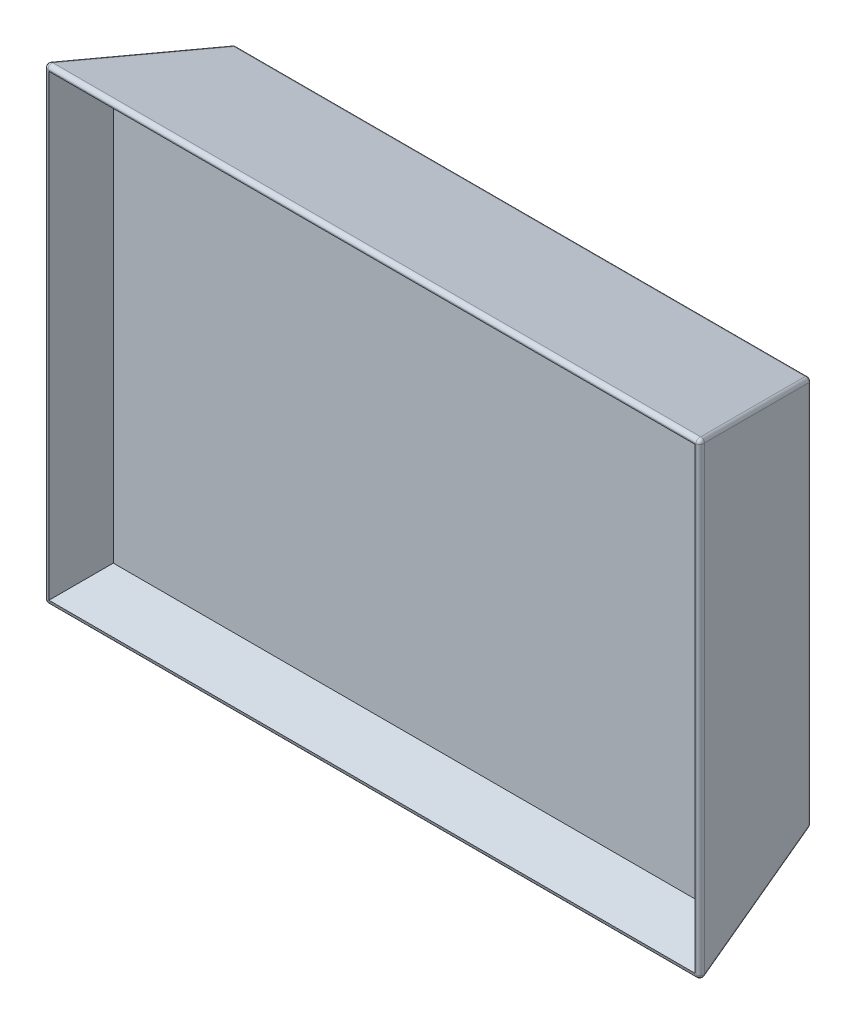
ISO-10303-21;
HEADER;
FILE_DESCRIPTION(('STEP AP214'),'2;1');
FILE_NAME('part.step','',(''),(''),'','','');
FILE_SCHEMA(('AUTOMOTIVE_DESIGN { 1 0 10303 214 1 1 1 1 }'));
ENDSEC;
DATA;
#1=APPLICATION_CONTEXT('core data for automotive mechanical design processes');
#2=APPLICATION_PROTOCOL_DEFINITION('international standard','automotive_design',2000,#1);
#3=PRODUCT_CONTEXT('',#1,'mechanical');
#4=PRODUCT('Part','Part','',(#3));
#5=PRODUCT_RELATED_PRODUCT_CATEGORY('part','',(#4));
#6=PRODUCT_DEFINITION_FORMATION('','',#4);
#7=PRODUCT_DEFINITION_CONTEXT('part definition',#1,'design');
#8=PRODUCT_DEFINITION('design','',#6,#7);
#9=PRODUCT_DEFINITION_SHAPE('','',#8);
#10=(LENGTH_UNIT() NAMED_UNIT(*) SI_UNIT(.MILLI.,.METRE.));
#11=(NAMED_UNIT(*) PLANE_ANGLE_UNIT() SI_UNIT($,.RADIAN.));
#12=(NAMED_UNIT(*) SI_UNIT($,.STERADIAN.) SOLID_ANGLE_UNIT());
#13=UNCERTAINTY_MEASURE_WITH_UNIT(LENGTH_MEASURE(1.E-05),#10,'distance_accuracy_value','');
#14=(GEOMETRIC_REPRESENTATION_CONTEXT(3) GLOBAL_UNCERTAINTY_ASSIGNED_CONTEXT((#13)) GLOBAL_UNIT_ASSIGNED_CONTEXT((#10,
#11,#12)) REPRESENTATION_CONTEXT('',''));
#15=CARTESIAN_POINT('',(0.,0.,0.));
#16=DIRECTION('',(0.,0.,1.));
#17=DIRECTION('',(1.,0.,0.));
#18=AXIS2_PLACEMENT_3D('',#15,#16,#17);
#19=CARTESIAN_POINT('',(326.262083641573,-226.262083641573,3.));
#20=DIRECTION('',(0.965925826289068,0.,-0.258819045102521));
#21=DIRECTION('',(-0.258819045102521,0.,-0.965925826289068));
#22=AXIS2_PLACEMENT_3D('',#19,#20,#21);
#23=PLANE('',#22);
#24=DIRECTION('',(0.,1.,0.));
#25=VECTOR('',#24,1.);
#26=CARTESIAN_POINT('',(326.262083641573,-226.262083641573,3.));
#27=LINE('',#26,#25);
#28=CARTESIAN_POINT('',(326.262083641573,-226.262083641573,3.));
#29=VERTEX_POINT('',#28);
#30=CARTESIAN_POINT('',(326.262083641573,-23.7379163584267,3.));
#31=VERTEX_POINT('',#30);
#32=EDGE_CURVE('E90',#29,#31,#27,.T.);
#33=ORIENTED_EDGE('',*,*,#32,.T.);
#34=DIRECTION('',(-0.250562807085732,-0.250562807085732,-0.935113126531029));
#35=VECTOR('',#34,1.);
#36=CARTESIAN_POINT('',(326.262083641573,-23.7379163584267,3.));
#37=LINE('',#36,#35);
#38=CARTESIAN_POINT('',(339.659543263129,-10.3404567368706,53.));
#39=VERTEX_POINT('',#38);
#40=EDGE_CURVE('E12',#39,#31,#37,.T.);
#41=ORIENTED_EDGE('',*,*,#40,.F.);
#42=DIRECTION('',(0.,-1.,0.));
#43=VECTOR('',#42,1.);
#44=CARTESIAN_POINT('',(339.659543263129,-226.262083641573,53.));
#45=LINE('',#44,#43);
#46=CARTESIAN_POINT('',(339.659543263129,-239.659543263129,53.));
#47=VERTEX_POINT('',#46);
#48=EDGE_CURVE('E106',#47,#39,#45,.F.);
#49=ORIENTED_EDGE('',*,*,#48,.F.);
#50=DIRECTION('',(-0.250562807085732,0.250562807085732,-0.935113126531029));
#51=VECTOR('',#50,1.);
#52=CARTESIAN_POINT('',(326.262083641573,-226.262083641573,3.));
#53=LINE('',#52,#51);
#54=EDGE_CURVE('E101',#47,#29,#53,.T.);
#55=ORIENTED_EDGE('',*,*,#54,.T.);
#56=EDGE_LOOP('',(#33,#41,#49,#55));
#57=FACE_BOUND('',#56,.T.);
#58=ADVANCED_FACE('F44',(#57),#23,.T.);
#59=CARTESIAN_POINT('',(326.262083641573,-23.7379163584267,3.));
#60=DIRECTION('',(0.,0.965925826289068,-0.258819045102521));
#61=DIRECTION('',(0.,0.258819045102521,0.965925826289068));
#62=AXIS2_PLACEMENT_3D('',#59,#60,#61);
#63=PLANE('',#62);
#64=DIRECTION('',(-1.,0.,0.));
#65=VECTOR('',#64,1.);
#66=CARTESIAN_POINT('',(326.262083641573,-23.7379163584267,3.));
#67=LINE('',#66,#65);
#68=CARTESIAN_POINT('',(23.7379163584268,-23.7379163584267,3.));
#69=VERTEX_POINT('',#68);
#70=EDGE_CURVE('E86',#31,#69,#67,.T.);
#71=ORIENTED_EDGE('',*,*,#70,.T.);
#72=DIRECTION('',(0.250562807085732,-0.250562807085732,-0.935113126531029));
#73=VECTOR('',#72,1.);
#74=CARTESIAN_POINT('',(36.4527319817106,-36.4527319817106,-44.4523379149658));
#75=LINE('',#74,#73);
#76=CARTESIAN_POINT('',(10.3404567368706,-10.3404567368706,53.));
#77=VERTEX_POINT('',#76);
#78=EDGE_CURVE('E53',#77,#69,#75,.T.);
#79=ORIENTED_EDGE('',*,*,#78,.F.);
#80=DIRECTION('',(1.,0.,0.));
#81=VECTOR('',#80,1.);
#82=CARTESIAN_POINT('',(326.262083641573,-10.3404567368706,53.));
#83=LINE('',#82,#81);
#84=EDGE_CURVE('E97',#39,#77,#83,.F.);
#85=ORIENTED_EDGE('',*,*,#84,.F.);
#86=ORIENTED_EDGE('',*,*,#40,.T.);
#87=EDGE_LOOP('',(#71,#79,#85,#86));
#88=FACE_BOUND('',#87,.T.);
#89=ADVANCED_FACE('F46',(#88),#63,.T.);
#90=CARTESIAN_POINT('',(23.7379163584268,-226.262083641573,3.));
#91=DIRECTION('',(-0.965925826289068,0.,-0.258819045102521));
#92=DIRECTION('',(-0.258819045102521,0.,0.965925826289068));
#93=AXIS2_PLACEMENT_3D('',#90,#91,#92);
#94=PLANE('',#93);
#95=DIRECTION('',(0.,-1.,0.));
#96=VECTOR('',#95,1.);
#97=CARTESIAN_POINT('',(23.7379163584268,-226.262083641573,3.));
#98=LINE('',#97,#96);
#99=CARTESIAN_POINT('',(23.7379163584268,-226.262083641573,3.));
#100=VERTEX_POINT('',#99);
#101=EDGE_CURVE('E91',#69,#100,#98,.T.);
#102=ORIENTED_EDGE('',*,*,#101,.T.);
#103=DIRECTION('',(0.250562807085732,0.250562807085732,-0.935113126531029));
#104=VECTOR('',#103,1.);
#105=CARTESIAN_POINT('',(42.7309040111788,-207.269095988821,-67.8827949075988));
#106=LINE('',#105,#104);
#107=CARTESIAN_POINT('',(10.3404567368706,-239.659543263129,53.));
#108=VERTEX_POINT('',#107);
#109=EDGE_CURVE('E109',#108,#100,#106,.T.);
#110=ORIENTED_EDGE('',*,*,#109,.F.);
#111=DIRECTION('',(0.,1.,0.));
#112=VECTOR('',#111,1.);
#113=CARTESIAN_POINT('',(10.3404567368706,-226.262083641573,53.));
#114=LINE('',#113,#112);
#115=EDGE_CURVE('E65',#77,#108,#114,.F.);
#116=ORIENTED_EDGE('',*,*,#115,.F.);
#117=ORIENTED_EDGE('',*,*,#78,.T.);
#118=EDGE_LOOP('',(#102,#110,#116,#117));
#119=FACE_BOUND('',#118,.T.);
#120=ADVANCED_FACE('F116',(#119),#94,.T.);
#121=CARTESIAN_POINT('',(326.262083641573,-226.262083641573,3.));
#122=DIRECTION('',(0.,-0.965925826289068,-0.258819045102521));
#123=DIRECTION('',(0.,0.258819045102521,-0.965925826289068));
#124=AXIS2_PLACEMENT_3D('',#121,#122,#123);
#125=PLANE('',#124);
#126=DIRECTION('',(1.,0.,0.));
#127=VECTOR('',#126,1.);
#128=CARTESIAN_POINT('',(326.262083641573,-226.262083641573,3.));
#129=LINE('',#128,#127);
#130=EDGE_CURVE('E105',#100,#29,#129,.T.);
#131=ORIENTED_EDGE('',*,*,#130,.T.);
#132=ORIENTED_EDGE('',*,*,#54,.F.);
#133=DIRECTION('',(-1.,0.,0.));
#134=VECTOR('',#133,1.);
#135=CARTESIAN_POINT('',(326.262083641573,-239.659543263129,53.));
#136=LINE('',#135,#134);
#137=EDGE_CURVE('E48',#108,#47,#136,.F.);
#138=ORIENTED_EDGE('',*,*,#137,.F.);
#139=ORIENTED_EDGE('',*,*,#109,.T.);
#140=EDGE_LOOP('',(#131,#132,#138,#139));
#141=FACE_BOUND('',#140,.T.);
#142=ADVANCED_FACE('F118',(#141),#125,.T.);
#143=CARTESIAN_POINT('',(0.,0.,53.));
#144=DIRECTION('',(0.,0.,1.));
#145=DIRECTION('',(1.,0.,0.));
#146=AXIS2_PLACEMENT_3D('',#143,#144,#145);
#147=PLANE('',#146);
#148=ORIENTED_EDGE('',*,*,#48,.T.);
#149=ORIENTED_EDGE('',*,*,#84,.T.);
#150=ORIENTED_EDGE('',*,*,#115,.T.);
#151=ORIENTED_EDGE('',*,*,#137,.T.);
#152=EDGE_LOOP('',(#148,#149,#150,#151));
#153=FACE_BOUND('',#152,.T.);
#154=ADVANCED_FACE('F114',(#153),#147,.T.);
#155=CARTESIAN_POINT('',(0.,0.,3.));
#156=DIRECTION('',(0.,0.,1.));
#157=DIRECTION('',(1.,0.,0.));
#158=AXIS2_PLACEMENT_3D('',#155,#156,#157);
#159=PLANE('',#158);
#160=ORIENTED_EDGE('',*,*,#32,.F.);
#161=ORIENTED_EDGE('',*,*,#130,.F.);
#162=ORIENTED_EDGE('',*,*,#101,.F.);
#163=ORIENTED_EDGE('',*,*,#70,.F.);
#164=EDGE_LOOP('',(#160,#161,#162,#163));
#165=FACE_BOUND('',#164,.T.);
#166=ADVANCED_FACE('F87',(#165),#159,.F.);
#167=CLOSED_SHELL('',(#58,#89,#120,#142,#154,#166));
#168=MANIFOLD_SOLID_BREP('B2',#167);
#169=CARTESIAN_POINT('',(0.,0.,80.));
#170=DIRECTION('',(0.,0.,1.));
#171=DIRECTION('',(1.,0.,0.));
#172=AXIS2_PLACEMENT_3D('',#169,#170,#171);
#173=PLANE('',#172);
#174=DIRECTION('',(1.,0.,0.));
#175=VECTOR('',#174,1.);
#176=CARTESIAN_POINT('',(0.,-2.60645074568241,80.));
#177=LINE('',#176,#175);
#178=CARTESIAN_POINT('',(347.393549254318,-2.60645074568241,80.));
#179=VERTEX_POINT('',#178);
#180=CARTESIAN_POINT('',(2.60645074568241,-2.60645074568241,80.));
#181=VERTEX_POINT('',#180);
#182=EDGE_CURVE('E321',#179,#181,#177,.F.);
#183=ORIENTED_EDGE('',*,*,#182,.T.);
#184=DIRECTION('',(0.,1.,0.));
#185=VECTOR('',#184,1.);
#186=CARTESIAN_POINT('',(2.60645074568244,-250.,80.));
#187=LINE('',#186,#185);
#188=CARTESIAN_POINT('',(2.60645074568244,-247.393549254318,80.));
#189=VERTEX_POINT('',#188);
#190=EDGE_CURVE('E327',#181,#189,#187,.F.);
#191=ORIENTED_EDGE('',*,*,#190,.T.);
#192=DIRECTION('',(-1.,0.,0.));
#193=VECTOR('',#192,1.);
#194=CARTESIAN_POINT('',(350.,-247.393549254318,80.));
#195=LINE('',#194,#193);
#196=CARTESIAN_POINT('',(347.393549254318,-247.393549254318,80.));
#197=VERTEX_POINT('',#196);
#198=EDGE_CURVE('E325',#189,#197,#195,.F.);
#199=ORIENTED_EDGE('',*,*,#198,.T.);
#200=DIRECTION('',(0.,-1.,0.));
#201=VECTOR('',#200,1.);
#202=CARTESIAN_POINT('',(347.393549254318,0.,80.));
#203=LINE('',#202,#201);
#204=EDGE_CURVE('E323',#197,#179,#203,.F.);
#205=ORIENTED_EDGE('',*,*,#204,.T.);
#206=EDGE_LOOP('',(#183,#191,#199,#205));
#207=FACE_BOUND('',#206,.T.);
#208=DIRECTION('',(0.,-1.,0.));
#209=VECTOR('',#208,1.);
#210=CARTESIAN_POINT('',(3.10582854123025,0.,80.));
#211=LINE('',#210,#209);
#212=CARTESIAN_POINT('',(3.10582854123028,-246.89417145877,80.));
#213=VERTEX_POINT('',#212);
#214=CARTESIAN_POINT('',(3.10582854123025,-3.10582854123025,80.));
#215=VERTEX_POINT('',#214);
#216=EDGE_CURVE('E297',#213,#215,#211,.F.);
#217=ORIENTED_EDGE('',*,*,#216,.T.);
#218=DIRECTION('',(1.,0.,0.));
#219=VECTOR('',#218,1.);
#220=CARTESIAN_POINT('',(0.,-3.10582854123025,80.));
#221=LINE('',#220,#219);
#222=CARTESIAN_POINT('',(346.89417145877,-3.10582854123025,80.));
#223=VERTEX_POINT('',#222);
#224=EDGE_CURVE('E308',#215,#223,#221,.T.);
#225=ORIENTED_EDGE('',*,*,#224,.T.);
#226=DIRECTION('',(0.,-1.,0.));
#227=VECTOR('',#226,1.);
#228=CARTESIAN_POINT('',(346.89417145877,0.,80.));
#229=LINE('',#228,#227);
#230=CARTESIAN_POINT('',(346.89417145877,-246.89417145877,80.));
#231=VERTEX_POINT('',#230);
#232=EDGE_CURVE('E309',#223,#231,#229,.T.);
#233=ORIENTED_EDGE('',*,*,#232,.T.);
#234=DIRECTION('',(-1.,0.,0.));
#235=VECTOR('',#234,1.);
#236=CARTESIAN_POINT('',(0.,-246.89417145877,80.));
#237=LINE('',#236,#235);
#238=EDGE_CURVE('E184',#213,#231,#237,.F.);
#239=ORIENTED_EDGE('',*,*,#238,.F.);
#240=EDGE_LOOP('',(#217,#225,#233,#239));
#241=FACE_BOUND('',#240,.T.);
#242=ADVANCED_FACE('F167',(#207,#241),#173,.T.);
#243=CARTESIAN_POINT('',(0.,0.,80.));
#244=DIRECTION('',(-0.965925826289068,0.,-0.258819045102521));
#245=DIRECTION('',(-0.258819045102521,0.,0.965925826289068));
#246=AXIS2_PLACEMENT_3D('',#243,#244,#245);
#247=PLANE('',#246);
#248=DIRECTION('',(0.,-1.,0.));
#249=VECTOR('',#248,1.);
#250=CARTESIAN_POINT('',(21.0387377178697,0.,1.48236190979496));
#251=LINE('',#250,#249);
#252=CARTESIAN_POINT('',(21.0387377178697,-22.9705893704478,1.48236190979496));
#253=VERTEX_POINT('',#252);
#254=CARTESIAN_POINT('',(21.0387377178697,-227.029410629552,1.48236190979496));
#255=VERTEX_POINT('',#254);
#256=EDGE_CURVE('E332',#253,#255,#251,.T.);
#257=ORIENTED_EDGE('',*,*,#256,.T.);
#258=DIRECTION('',(-0.250562807085732,-0.250562807085732,0.935113126531029));
#259=VECTOR('',#258,1.);
#260=CARTESIAN_POINT('',(15.5741451035675,-232.494003243854,21.8764991890363));
#261=LINE('',#260,#259);
#262=CARTESIAN_POINT('',(0.674599093104307,-247.393549254318,77.482361909795));
#263=VERTEX_POINT('',#262);
#264=EDGE_CURVE('E337',#255,#263,#261,.T.);
#265=ORIENTED_EDGE('',*,*,#264,.T.);
#266=DIRECTION('',(0.,-1.,0.));
#267=VECTOR('',#266,1.);
#268=CARTESIAN_POINT('',(0.674599093104276,0.,77.482361909795));
#269=LINE('',#268,#267);
#270=CARTESIAN_POINT('',(0.674599093104277,-2.60645074568241,77.482361909795));
#271=VERTEX_POINT('',#270);
#272=EDGE_CURVE('E334',#263,#271,#269,.F.);
#273=ORIENTED_EDGE('',*,*,#272,.T.);
#274=DIRECTION('',(0.250562807085732,-0.250562807085732,-0.935113126531029));
#275=VECTOR('',#274,1.);
#276=CARTESIAN_POINT('',(21.3146504243869,-23.246502076965,0.452641670618783));
#277=LINE('',#276,#275);
#278=EDGE_CURVE('E330',#271,#253,#277,.T.);
#279=ORIENTED_EDGE('',*,*,#278,.T.);
#280=EDGE_LOOP('',(#257,#265,#273,#279));
#281=FACE_BOUND('',#280,.T.);
#282=ADVANCED_FACE('F529',(#281),#247,.T.);
#283=CARTESIAN_POINT('',(0.,-250.,80.));
#284=DIRECTION('',(0.,-0.965925826289068,-0.258819045102521));
#285=DIRECTION('',(0.,0.258819045102521,-0.965925826289068));
#286=AXIS2_PLACEMENT_3D('',#283,#284,#285);
#287=PLANE('',#286);
#288=DIRECTION('',(1.,0.,0.));
#289=VECTOR('',#288,1.);
#290=CARTESIAN_POINT('',(0.,-249.325400906896,77.482361909795));
#291=LINE('',#290,#289);
#292=CARTESIAN_POINT('',(347.393549254318,-249.325400906896,77.482361909795));
#293=VERTEX_POINT('',#292);
#294=CARTESIAN_POINT('',(2.60645074568244,-249.325400906896,77.482361909795));
#295=VERTEX_POINT('',#294);
#296=EDGE_CURVE('E352',#293,#295,#291,.F.);
#297=ORIENTED_EDGE('',*,*,#296,.T.);
#298=DIRECTION('',(-0.250562807085732,-0.250562807085732,0.935113126531029));
#299=VECTOR('',#298,1.);
#300=CARTESIAN_POINT('',(1.81056668247518,-250.121284970103,80.4526416706188));
#301=LINE('',#300,#299);
#302=CARTESIAN_POINT('',(22.9705893704478,-228.96126228213,1.48236190979496));
#303=VERTEX_POINT('',#302);
#304=EDGE_CURVE('E354',#295,#303,#301,.F.);
#305=ORIENTED_EDGE('',*,*,#304,.T.);
#306=DIRECTION('',(1.,0.,0.));
#307=VECTOR('',#306,1.);
#308=CARTESIAN_POINT('',(0.,-228.96126228213,1.48236190979496));
#309=LINE('',#308,#307);
#310=CARTESIAN_POINT('',(327.029410629552,-228.96126228213,1.48236190979496));
#311=VERTEX_POINT('',#310);
#312=EDGE_CURVE('E350',#303,#311,#309,.T.);
#313=ORIENTED_EDGE('',*,*,#312,.T.);
#314=DIRECTION('',(-0.250562807085732,0.250562807085732,-0.935113126531029));
#315=VECTOR('',#314,1.);
#316=CARTESIAN_POINT('',(348.189433317525,-250.121284970103,80.4526416706188));
#317=LINE('',#316,#315);
#318=EDGE_CURVE('E348',#311,#293,#317,.F.);
#319=ORIENTED_EDGE('',*,*,#318,.T.);
#320=EDGE_LOOP('',(#297,#305,#313,#319));
#321=FACE_BOUND('',#320,.T.);
#322=ADVANCED_FACE('F534',(#321),#287,.T.);
#323=CARTESIAN_POINT('',(350.,0.,80.));
#324=DIRECTION('',(0.965925826289068,0.,-0.258819045102521));
#325=DIRECTION('',(-0.258819045102521,0.,-0.965925826289068));
#326=AXIS2_PLACEMENT_3D('',#323,#324,#325);
#327=PLANE('',#326);
#328=DIRECTION('',(0.,-1.,0.));
#329=VECTOR('',#328,1.);
#330=CARTESIAN_POINT('',(349.325400906896,0.,77.4823619097949));
#331=LINE('',#330,#329);
#332=CARTESIAN_POINT('',(349.325400906896,-2.60645074568242,77.4823619097949));
#333=VERTEX_POINT('',#332);
#334=CARTESIAN_POINT('',(349.325400906896,-247.393549254318,77.4823619097949));
#335=VERTEX_POINT('',#334);
#336=EDGE_CURVE('E361',#333,#335,#331,.T.);
#337=ORIENTED_EDGE('',*,*,#336,.T.);
#338=DIRECTION('',(0.250562807085732,-0.250562807085732,0.935113126531029));
#339=VECTOR('',#338,1.);
#340=CARTESIAN_POINT('',(328.685349575613,-226.753497923035,0.452641670618784));
#341=LINE('',#340,#339);
#342=CARTESIAN_POINT('',(328.96126228213,-227.029410629552,1.48236190979495));
#343=VERTEX_POINT('',#342);
#344=EDGE_CURVE('E363',#335,#343,#341,.F.);
#345=ORIENTED_EDGE('',*,*,#344,.T.);
#346=DIRECTION('',(0.,-1.,0.));
#347=VECTOR('',#346,1.);
#348=CARTESIAN_POINT('',(328.96126228213,-21.4359353944899,1.48236190979495));
#349=LINE('',#348,#347);
#350=CARTESIAN_POINT('',(328.96126228213,-22.9705893704478,1.48236190979496));
#351=VERTEX_POINT('',#350);
#352=EDGE_CURVE('E359',#343,#351,#349,.F.);
#353=ORIENTED_EDGE('',*,*,#352,.T.);
#354=DIRECTION('',(-0.250562807085732,-0.250562807085732,-0.935113126531029));
#355=VECTOR('',#354,1.);
#356=CARTESIAN_POINT('',(350.121284970103,-1.81056668247516,80.4526416706188));
#357=LINE('',#356,#355);
#358=EDGE_CURVE('E357',#351,#333,#357,.F.);
#359=ORIENTED_EDGE('',*,*,#358,.T.);
#360=EDGE_LOOP('',(#337,#345,#353,#359));
#361=FACE_BOUND('',#360,.T.);
#362=ADVANCED_FACE('F477',(#361),#327,.T.);
#363=CARTESIAN_POINT('',(0.,0.,80.));
#364=DIRECTION('',(0.,0.965925826289068,-0.258819045102521));
#365=DIRECTION('',(0.,0.258819045102521,0.965925826289068));
#366=AXIS2_PLACEMENT_3D('',#363,#364,#365);
#367=PLANE('',#366);
#368=DIRECTION('',(1.,0.,0.));
#369=VECTOR('',#368,1.);
#370=CARTESIAN_POINT('',(0.,-0.674599093104276,77.482361909795));
#371=LINE('',#370,#369);
#372=CARTESIAN_POINT('',(2.60645074568241,-0.674599093104276,77.482361909795));
#373=VERTEX_POINT('',#372);
#374=CARTESIAN_POINT('',(347.393549254317,-0.674599093104276,77.482361909795));
#375=VERTEX_POINT('',#374);
#376=EDGE_CURVE('E176',#373,#375,#371,.T.);
#377=ORIENTED_EDGE('',*,*,#376,.T.);
#378=DIRECTION('',(-0.250562807085732,-0.250562807085732,-0.935113126531029));
#379=VECTOR('',#378,1.);
#380=CARTESIAN_POINT('',(326.215831214386,-21.8523171330356,-1.55395780359668));
#381=LINE('',#380,#379);
#382=CARTESIAN_POINT('',(327.029410629552,-21.0387377178697,1.48236190979496));
#383=VERTEX_POINT('',#382);
#384=EDGE_CURVE('E42',#375,#383,#381,.T.);
#385=ORIENTED_EDGE('',*,*,#384,.T.);
#386=DIRECTION('',(1.,0.,0.));
#387=VECTOR('',#386,1.);
#388=CARTESIAN_POINT('',(21.4359353944899,-21.0387377178697,1.48236190979496));
#389=LINE('',#388,#387);
#390=CARTESIAN_POINT('',(22.9705893704478,-21.0387377178697,1.48236190979496));
#391=VERTEX_POINT('',#390);
#392=EDGE_CURVE('E366',#383,#391,#389,.F.);
#393=ORIENTED_EDGE('',*,*,#392,.T.);
#394=DIRECTION('',(-0.250562807085732,0.250562807085732,0.935113126531029));
#395=VECTOR('',#394,1.);
#396=CARTESIAN_POINT('',(1.81056668247516,0.121284970102978,80.4526416706188));
#397=LINE('',#396,#395);
#398=EDGE_CURVE('E368',#391,#373,#397,.T.);
#399=ORIENTED_EDGE('',*,*,#398,.T.);
#400=EDGE_LOOP('',(#377,#385,#393,#399));
#401=FACE_BOUND('',#400,.T.);
#402=ADVANCED_FACE('F451',(#401),#367,.T.);
#403=CARTESIAN_POINT('',(0.,0.,0.));
#404=DIRECTION('',(0.,0.,1.));
#405=DIRECTION('',(1.,0.,0.));
#406=AXIS2_PLACEMENT_3D('',#403,#404,#405);
#407=PLANE('',#406);
#408=DIRECTION('',(-1.,0.,0.));
#409=VECTOR('',#408,1.);
#410=CARTESIAN_POINT('',(0.,-227.029410629552,0.));
#411=LINE('',#410,#409);
#412=CARTESIAN_POINT('',(327.029410629552,-227.029410629552,0.));
#413=VERTEX_POINT('',#412);
#414=CARTESIAN_POINT('',(22.9705893704478,-227.029410629552,0.));
#415=VERTEX_POINT('',#414);
#416=EDGE_CURVE('E343',#413,#415,#411,.T.);
#417=ORIENTED_EDGE('',*,*,#416,.T.);
#418=DIRECTION('',(0.,1.,0.));
#419=VECTOR('',#418,1.);
#420=CARTESIAN_POINT('',(22.9705893704478,0.,0.));
#421=LINE('',#420,#419);
#422=CARTESIAN_POINT('',(22.9705893704478,-22.9705893704478,0.));
#423=VERTEX_POINT('',#422);
#424=EDGE_CURVE('E345',#415,#423,#421,.T.);
#425=ORIENTED_EDGE('',*,*,#424,.T.);
#426=DIRECTION('',(1.,0.,0.));
#427=VECTOR('',#426,1.);
#428=CARTESIAN_POINT('',(328.56406460551,-22.9705893704478,0.));
#429=LINE('',#428,#427);
#430=CARTESIAN_POINT('',(327.029410629552,-22.9705893704478,0.));
#431=VERTEX_POINT('',#430);
#432=EDGE_CURVE('E339',#423,#431,#429,.T.);
#433=ORIENTED_EDGE('',*,*,#432,.T.);
#434=DIRECTION('',(0.,-1.,0.));
#435=VECTOR('',#434,1.);
#436=CARTESIAN_POINT('',(327.029410629552,-228.56406460551,0.));
#437=LINE('',#436,#435);
#438=EDGE_CURVE('E341',#431,#413,#437,.T.);
#439=ORIENTED_EDGE('',*,*,#438,.T.);
#440=EDGE_LOOP('',(#417,#425,#433,#439));
#441=FACE_BOUND('',#440,.T.);
#442=ADVANCED_FACE('F491',(#441),#407,.F.);
#443=CARTESIAN_POINT('',(327.029410629552,0.,2.));
#444=DIRECTION('',(0.,1.,0.));
#445=DIRECTION('',(-1.,0.,0.));
#446=AXIS2_PLACEMENT_3D('',#443,#444,#445);
#447=CYLINDRICAL_SURFACE('',#446,2.);
#448=CARTESIAN_POINT('',(327.029410629552,-22.9705893704478,2.));
#449=DIRECTION('',(0.,1.,0.));
#450=DIRECTION('',(0.,0.,1.));
#451=AXIS2_PLACEMENT_3D('',#448,#449,#450);
#452=CIRCLE('',#451,2.);
#453=EDGE_CURVE('E171',#351,#431,#452,.T.);
#454=ORIENTED_EDGE('',*,*,#453,.F.);
#455=ORIENTED_EDGE('',*,*,#352,.F.);
#456=CARTESIAN_POINT('',(327.029410629552,-227.029410629552,2.));
#457=DIRECTION('',(0.,-1.,0.));
#458=DIRECTION('',(0.,0.,-1.));
#459=AXIS2_PLACEMENT_3D('',#456,#457,#458);
#460=CIRCLE('',#459,2.);
#461=EDGE_CURVE('E430',#413,#343,#460,.T.);
#462=ORIENTED_EDGE('',*,*,#461,.F.);
#463=ORIENTED_EDGE('',*,*,#438,.F.);
#464=EDGE_LOOP('',(#454,#455,#462,#463));
#465=FACE_BOUND('',#464,.T.);
#466=ADVANCED_FACE('F169',(#465),#447,.T.);
#467=CARTESIAN_POINT('',(327.029410629552,-22.9705893704478,2.));
#468=DIRECTION('',(0.,0.,1.));
#469=DIRECTION('',(1.,0.,0.));
#470=AXIS2_PLACEMENT_3D('',#467,#468,#469);
#471=SPHERICAL_SURFACE('',#470,2.);
#472=CARTESIAN_POINT('',(327.029410629552,-22.9705893704478,2.));
#473=DIRECTION('',(-0.250562807085715,-0.250562807085733,-0.935113126531033));
#474=DIRECTION('',(0.,0.965925826289068,-0.258819045102521));
#475=AXIS2_PLACEMENT_3D('',#472,#473,#474);
#476=CIRCLE('',#475,2.);
#477=EDGE_CURVE('E425',#351,#383,#476,.F.);
#478=ORIENTED_EDGE('',*,*,#477,.F.);
#479=ORIENTED_EDGE('',*,*,#453,.T.);
#480=CARTESIAN_POINT('',(327.029410629552,-22.9705893704478,2.));
#481=DIRECTION('',(1.,0.,0.));
#482=DIRECTION('',(0.,1.,0.));
#483=AXIS2_PLACEMENT_3D('',#480,#481,#482);
#484=CIRCLE('',#483,2.);
#485=EDGE_CURVE('E428',#383,#431,#484,.F.);
#486=ORIENTED_EDGE('',*,*,#485,.F.);
#487=EDGE_LOOP('',(#478,#479,#486));
#488=FACE_BOUND('',#487,.T.);
#489=ADVANCED_FACE('F442',(#488),#471,.T.);
#490=CARTESIAN_POINT('',(327.029410629552,-227.029410629552,2.));
#491=DIRECTION('',(0.,0.,1.));
#492=DIRECTION('',(1.,0.,0.));
#493=AXIS2_PLACEMENT_3D('',#490,#491,#492);
#494=SPHERICAL_SURFACE('',#493,2.);
#495=CARTESIAN_POINT('',(327.029410629552,-227.029410629552,2.));
#496=DIRECTION('',(1.,0.,0.));
#497=DIRECTION('',(0.,0.,-1.));
#498=AXIS2_PLACEMENT_3D('',#495,#496,#497);
#499=CIRCLE('',#498,2.);
#500=EDGE_CURVE('E420',#413,#311,#499,.F.);
#501=ORIENTED_EDGE('',*,*,#500,.F.);
#502=ORIENTED_EDGE('',*,*,#461,.T.);
#503=CARTESIAN_POINT('',(327.029410629552,-227.029410629552,2.));
#504=DIRECTION('',(-0.250562807085732,0.250562807085723,-0.935113126531031));
#505=DIRECTION('',(-0.965925826289068,0.,0.258819045102521));
#506=AXIS2_PLACEMENT_3D('',#503,#504,#505);
#507=CIRCLE('',#506,2.);
#508=EDGE_CURVE('E423',#311,#343,#507,.F.);
#509=ORIENTED_EDGE('',*,*,#508,.F.);
#510=EDGE_LOOP('',(#501,#502,#509));
#511=FACE_BOUND('',#510,.T.);
#512=ADVANCED_FACE('F483',(#511),#494,.T.);
#513=CARTESIAN_POINT('',(0.,-22.9705893704478,2.));
#514=DIRECTION('',(-1.,0.,0.));
#515=DIRECTION('',(0.,0.,1.));
#516=AXIS2_PLACEMENT_3D('',#513,#514,#515);
#517=CYLINDRICAL_SURFACE('',#516,2.);
#518=ORIENTED_EDGE('',*,*,#485,.T.);
#519=ORIENTED_EDGE('',*,*,#432,.F.);
#520=CARTESIAN_POINT('',(22.9705893704478,-22.9705893704478,2.));
#521=DIRECTION('',(-1.,0.,0.));
#522=DIRECTION('',(0.,0.,1.));
#523=AXIS2_PLACEMENT_3D('',#520,#521,#522);
#524=CIRCLE('',#523,2.);
#525=EDGE_CURVE('E415',#391,#423,#524,.T.);
#526=ORIENTED_EDGE('',*,*,#525,.F.);
#527=ORIENTED_EDGE('',*,*,#392,.F.);
#528=EDGE_LOOP('',(#518,#519,#526,#527));
#529=FACE_BOUND('',#528,.T.);
#530=ADVANCED_FACE('F448',(#529),#517,.T.);
#531=CARTESIAN_POINT('',(326.215831214386,-23.7841687856138,-1.03631971339165));
#532=DIRECTION('',(-0.250562807085732,-0.250562807085732,-0.935113126531029));
#533=DIRECTION('',(0.,0.965925826289068,-0.258819045102521));
#534=AXIS2_PLACEMENT_3D('',#531,#532,#533);
#535=CYLINDRICAL_SURFACE('',#534,2.);
#536=ORIENTED_EDGE('',*,*,#477,.T.);
#537=ORIENTED_EDGE('',*,*,#384,.F.);
#538=CARTESIAN_POINT('',(347.393549254318,-2.60645074568242,78.));
#539=DIRECTION('',(0.25056280708573,0.25056280708573,0.93511312653103));
#540=DIRECTION('',(0.,-0.965925826289069,0.258819045102519));
#541=AXIS2_PLACEMENT_3D('',#538,#539,#540);
#542=CIRCLE('',#541,2.);
#543=EDGE_CURVE('E412',#333,#375,#542,.T.);
#544=ORIENTED_EDGE('',*,*,#543,.F.);
#545=ORIENTED_EDGE('',*,*,#358,.F.);
#546=EDGE_LOOP('',(#536,#537,#544,#545));
#547=FACE_BOUND('',#546,.T.);
#548=ADVANCED_FACE('F455',(#547),#535,.T.);
#549=CARTESIAN_POINT('',(347.393549254318,0.,78.));
#550=DIRECTION('',(0.,-1.,0.));
#551=DIRECTION('',(1.,0.,0.));
#552=AXIS2_PLACEMENT_3D('',#549,#550,#551);
#553=CYLINDRICAL_SURFACE('',#552,2.);
#554=CARTESIAN_POINT('',(347.393549254318,-247.393549254318,78.));
#555=DIRECTION('',(0.,-1.,0.));
#556=DIRECTION('',(0.,0.,-1.));
#557=AXIS2_PLACEMENT_3D('',#554,#555,#556);
#558=CIRCLE('',#557,2.);
#559=EDGE_CURVE('E406',#335,#197,#558,.T.);
#560=ORIENTED_EDGE('',*,*,#559,.F.);
#561=ORIENTED_EDGE('',*,*,#336,.F.);
#562=CARTESIAN_POINT('',(347.393549254318,-2.60645074568241,78.));
#563=DIRECTION('',(0.,1.,0.));
#564=DIRECTION('',(-1.,0.,0.));
#565=AXIS2_PLACEMENT_3D('',#562,#563,#564);
#566=CIRCLE('',#565,2.);
#567=EDGE_CURVE('E409',#179,#333,#566,.T.);
#568=ORIENTED_EDGE('',*,*,#567,.F.);
#569=ORIENTED_EDGE('',*,*,#204,.F.);
#570=EDGE_LOOP('',(#560,#561,#568,#569));
#571=FACE_BOUND('',#570,.T.);
#572=ADVANCED_FACE('F474',(#571),#553,.T.);
#573=CARTESIAN_POINT('',(332.494003243854,-232.494003243854,22.3941372792413));
#574=DIRECTION('',(-0.250562807085732,0.250562807085732,-0.935113126531029));
#575=DIRECTION('',(-0.965925826289068,0.,0.258819045102521));
#576=AXIS2_PLACEMENT_3D('',#573,#574,#575);
#577=CYLINDRICAL_SURFACE('',#576,2.);
#578=ORIENTED_EDGE('',*,*,#508,.T.);
#579=ORIENTED_EDGE('',*,*,#344,.F.);
#580=CARTESIAN_POINT('',(347.393549254318,-247.393549254318,78.));
#581=DIRECTION('',(0.250562807085746,-0.250562807085729,0.935113126531026));
#582=DIRECTION('',(0.965925826289064,0.,-0.258819045102536));
#583=AXIS2_PLACEMENT_3D('',#580,#581,#582);
#584=CIRCLE('',#583,2.);
#585=EDGE_CURVE('E403',#293,#335,#584,.T.);
#586=ORIENTED_EDGE('',*,*,#585,.F.);
#587=ORIENTED_EDGE('',*,*,#318,.F.);
#588=EDGE_LOOP('',(#578,#579,#586,#587));
#589=FACE_BOUND('',#588,.T.);
#590=ADVANCED_FACE('F480',(#589),#577,.T.);
#591=CARTESIAN_POINT('',(0.,-227.029410629552,2.));
#592=DIRECTION('',(-1.,0.,0.));
#593=DIRECTION('',(0.,0.,1.));
#594=AXIS2_PLACEMENT_3D('',#591,#592,#593);
#595=CYLINDRICAL_SURFACE('',#594,2.);
#596=ORIENTED_EDGE('',*,*,#500,.T.);
#597=ORIENTED_EDGE('',*,*,#312,.F.);
#598=CARTESIAN_POINT('',(22.9705893704478,-227.029410629552,2.));
#599=DIRECTION('',(-1.,0.,0.));
#600=DIRECTION('',(0.,0.,1.));
#601=AXIS2_PLACEMENT_3D('',#598,#599,#600);
#602=CIRCLE('',#601,2.);
#603=EDGE_CURVE('E400',#415,#303,#602,.T.);
#604=ORIENTED_EDGE('',*,*,#603,.F.);
#605=ORIENTED_EDGE('',*,*,#416,.F.);
#606=EDGE_LOOP('',(#596,#597,#604,#605));
#607=FACE_BOUND('',#606,.T.);
#608=ADVANCED_FACE('F488',(#607),#595,.T.);
#609=CARTESIAN_POINT('',(22.9705893704478,0.,2.));
#610=DIRECTION('',(0.,1.,0.));
#611=DIRECTION('',(-1.,0.,0.));
#612=AXIS2_PLACEMENT_3D('',#609,#610,#611);
#613=CYLINDRICAL_SURFACE('',#612,2.);
#614=CARTESIAN_POINT('',(22.9705893704478,-22.9705893704478,2.));
#615=DIRECTION('',(0.,1.,0.));
#616=DIRECTION('',(-1.,0.,0.));
#617=AXIS2_PLACEMENT_3D('',#614,#615,#616);
#618=CIRCLE('',#617,2.);
#619=EDGE_CURVE('E417',#423,#253,#618,.T.);
#620=ORIENTED_EDGE('',*,*,#619,.F.);
#621=ORIENTED_EDGE('',*,*,#424,.F.);
#622=CARTESIAN_POINT('',(22.9705893704478,-227.029410629552,2.));
#623=DIRECTION('',(0.,-1.,0.));
#624=DIRECTION('',(0.,0.,-1.));
#625=AXIS2_PLACEMENT_3D('',#622,#623,#624);
#626=CIRCLE('',#625,2.);
#627=EDGE_CURVE('E397',#255,#415,#626,.T.);
#628=ORIENTED_EDGE('',*,*,#627,.F.);
#629=ORIENTED_EDGE('',*,*,#256,.F.);
#630=EDGE_LOOP('',(#620,#621,#628,#629));
#631=FACE_BOUND('',#630,.T.);
#632=ADVANCED_FACE('F495',(#631),#613,.T.);
#633=CARTESIAN_POINT('',(22.9705893704478,-22.9705893704478,2.));
#634=DIRECTION('',(0.,0.,1.));
#635=DIRECTION('',(1.,0.,0.));
#636=AXIS2_PLACEMENT_3D('',#633,#634,#635);
#637=SPHERICAL_SURFACE('',#636,2.);
#638=ORIENTED_EDGE('',*,*,#525,.T.);
#639=ORIENTED_EDGE('',*,*,#619,.T.);
#640=CARTESIAN_POINT('',(22.9705893704478,-22.9705893704478,2.));
#641=DIRECTION('',(0.250562807085732,-0.250562807085733,-0.935113126531029));
#642=DIRECTION('',(0.,0.965925826289068,-0.258819045102522));
#643=AXIS2_PLACEMENT_3D('',#640,#641,#642);
#644=CIRCLE('',#643,2.);
#645=EDGE_CURVE('E394',#391,#253,#644,.F.);
#646=ORIENTED_EDGE('',*,*,#645,.F.);
#647=EDGE_LOOP('',(#638,#639,#646));
#648=FACE_BOUND('',#647,.T.);
#649=ADVANCED_FACE('F499',(#648),#637,.T.);
#650=CARTESIAN_POINT('',(347.393549254318,-2.60645074568241,78.));
#651=DIRECTION('',(0.,0.,1.));
#652=DIRECTION('',(1.,0.,0.));
#653=AXIS2_PLACEMENT_3D('',#650,#651,#652);
#654=SPHERICAL_SURFACE('',#653,2.);
#655=ORIENTED_EDGE('',*,*,#567,.T.);
#656=ORIENTED_EDGE('',*,*,#543,.T.);
#657=CARTESIAN_POINT('',(347.393549254317,-2.60645074568241,78.));
#658=DIRECTION('',(1.,0.,0.));
#659=DIRECTION('',(0.,0.,-1.));
#660=AXIS2_PLACEMENT_3D('',#657,#658,#659);
#661=CIRCLE('',#660,2.);
#662=EDGE_CURVE('E391',#179,#375,#661,.F.);
#663=ORIENTED_EDGE('',*,*,#662,.F.);
#664=EDGE_LOOP('',(#655,#656,#663));
#665=FACE_BOUND('',#664,.T.);
#666=ADVANCED_FACE('F458',(#665),#654,.T.);
#667=CARTESIAN_POINT('',(347.393549254318,-247.393549254318,78.));
#668=DIRECTION('',(0.,0.,1.));
#669=DIRECTION('',(1.,0.,0.));
#670=AXIS2_PLACEMENT_3D('',#667,#668,#669);
#671=SPHERICAL_SURFACE('',#670,2.);
#672=ORIENTED_EDGE('',*,*,#585,.T.);
#673=ORIENTED_EDGE('',*,*,#559,.T.);
#674=CARTESIAN_POINT('',(347.393549254318,-247.393549254318,78.));
#675=DIRECTION('',(1.,0.,0.));
#676=DIRECTION('',(0.,1.,0.));
#677=AXIS2_PLACEMENT_3D('',#674,#675,#676);
#678=CIRCLE('',#677,2.);
#679=EDGE_CURVE('E388',#293,#197,#678,.F.);
#680=ORIENTED_EDGE('',*,*,#679,.F.);
#681=EDGE_LOOP('',(#672,#673,#680));
#682=FACE_BOUND('',#681,.T.);
#683=ADVANCED_FACE('F517',(#682),#671,.T.);
#684=CARTESIAN_POINT('',(22.9705893704478,-227.029410629552,2.));
#685=DIRECTION('',(0.,0.,1.));
#686=DIRECTION('',(1.,0.,0.));
#687=AXIS2_PLACEMENT_3D('',#684,#685,#686);
#688=SPHERICAL_SURFACE('',#687,2.);
#689=ORIENTED_EDGE('',*,*,#627,.T.);
#690=ORIENTED_EDGE('',*,*,#603,.T.);
#691=CARTESIAN_POINT('',(22.9705893704478,-227.029410629552,2.));
#692=DIRECTION('',(0.250562807085731,0.250562807085731,-0.93511312653103));
#693=DIRECTION('',(0.,0.965925826289068,0.258819045102521));
#694=AXIS2_PLACEMENT_3D('',#691,#692,#693);
#695=CIRCLE('',#694,2.);
#696=EDGE_CURVE('E386',#255,#303,#695,.F.);
#697=ORIENTED_EDGE('',*,*,#696,.F.);
#698=EDGE_LOOP('',(#689,#690,#697));
#699=FACE_BOUND('',#698,.T.);
#700=ADVANCED_FACE('F519',(#699),#688,.T.);
#701=CARTESIAN_POINT('',(1.81056668247516,-1.81056668247516,80.9702797608238));
#702=DIRECTION('',(0.250562807085732,-0.250562807085732,-0.935113126531029));
#703=DIRECTION('',(-0.965925826289068,0.,-0.258819045102521));
#704=AXIS2_PLACEMENT_3D('',#701,#702,#703);
#705=CYLINDRICAL_SURFACE('',#704,2.);
#706=ORIENTED_EDGE('',*,*,#645,.T.);
#707=ORIENTED_EDGE('',*,*,#278,.F.);
#708=CARTESIAN_POINT('',(2.60645074568241,-2.60645074568241,78.));
#709=DIRECTION('',(-0.250562807085731,0.25056280708573,0.93511312653103));
#710=DIRECTION('',(0.965925826289069,0.,0.25881904510252));
#711=AXIS2_PLACEMENT_3D('',#708,#709,#710);
#712=CIRCLE('',#711,2.);
#713=EDGE_CURVE('E383',#373,#271,#712,.T.);
#714=ORIENTED_EDGE('',*,*,#713,.F.);
#715=ORIENTED_EDGE('',*,*,#398,.F.);
#716=EDGE_LOOP('',(#706,#707,#714,#715));
#717=FACE_BOUND('',#716,.T.);
#718=ADVANCED_FACE('F502',(#717),#705,.T.);
#719=CARTESIAN_POINT('',(0.,-2.60645074568241,78.));
#720=DIRECTION('',(1.,0.,0.));
#721=DIRECTION('',(0.,0.,-1.));
#722=AXIS2_PLACEMENT_3D('',#719,#720,#721);
#723=CYLINDRICAL_SURFACE('',#722,2.);
#724=ORIENTED_EDGE('',*,*,#662,.T.);
#725=ORIENTED_EDGE('',*,*,#376,.F.);
#726=CARTESIAN_POINT('',(2.60645074568241,-2.60645074568241,78.));
#727=DIRECTION('',(-1.,0.,0.));
#728=DIRECTION('',(0.,-1.,0.));
#729=AXIS2_PLACEMENT_3D('',#726,#727,#728);
#730=CIRCLE('',#729,2.);
#731=EDGE_CURVE('E380',#181,#373,#730,.T.);
#732=ORIENTED_EDGE('',*,*,#731,.F.);
#733=ORIENTED_EDGE('',*,*,#182,.F.);
#734=EDGE_LOOP('',(#724,#725,#732,#733));
#735=FACE_BOUND('',#734,.T.);
#736=ADVANCED_FACE('F462',(#735),#723,.T.);
#737=CARTESIAN_POINT('',(0.,-247.393549254318,78.));
#738=DIRECTION('',(1.,0.,0.));
#739=DIRECTION('',(0.,0.,-1.));
#740=AXIS2_PLACEMENT_3D('',#737,#738,#739);
#741=CYLINDRICAL_SURFACE('',#740,2.);
#742=ORIENTED_EDGE('',*,*,#679,.T.);
#743=ORIENTED_EDGE('',*,*,#198,.F.);
#744=CARTESIAN_POINT('',(2.60645074568244,-247.393549254318,78.));
#745=DIRECTION('',(-1.,0.,0.));
#746=DIRECTION('',(0.,0.,1.));
#747=AXIS2_PLACEMENT_3D('',#744,#745,#746);
#748=CIRCLE('',#747,2.);
#749=EDGE_CURVE('E377',#295,#189,#748,.T.);
#750=ORIENTED_EDGE('',*,*,#749,.F.);
#751=ORIENTED_EDGE('',*,*,#296,.F.);
#752=EDGE_LOOP('',(#742,#743,#750,#751));
#753=FACE_BOUND('',#752,.T.);
#754=ADVANCED_FACE('F515',(#753),#741,.T.);
#755=CARTESIAN_POINT('',(1.81056668247519,-248.189433317525,80.9702797608238));
#756=DIRECTION('',(0.250562807085732,0.250562807085732,-0.935113126531029));
#757=DIRECTION('',(-0.965925826289068,0.,-0.258819045102521));
#758=AXIS2_PLACEMENT_3D('',#755,#756,#757);
#759=CYLINDRICAL_SURFACE('',#758,2.);
#760=ORIENTED_EDGE('',*,*,#696,.T.);
#761=ORIENTED_EDGE('',*,*,#304,.F.);
#762=CARTESIAN_POINT('',(2.60645074568244,-247.393549254318,78.));
#763=DIRECTION('',(-0.250562807085731,-0.250562807085726,0.935113126531031));
#764=DIRECTION('',(0.965925826289069,0.,0.25881904510252));
#765=AXIS2_PLACEMENT_3D('',#762,#763,#764);
#766=CIRCLE('',#765,2.);
#767=EDGE_CURVE('E374',#263,#295,#766,.T.);
#768=ORIENTED_EDGE('',*,*,#767,.F.);
#769=ORIENTED_EDGE('',*,*,#264,.F.);
#770=EDGE_LOOP('',(#760,#761,#768,#769));
#771=FACE_BOUND('',#770,.T.);
#772=ADVANCED_FACE('F555',(#771),#759,.T.);
#773=CARTESIAN_POINT('',(2.60645074568241,-2.60645074568241,78.));
#774=DIRECTION('',(0.,0.,1.));
#775=DIRECTION('',(1.,0.,0.));
#776=AXIS2_PLACEMENT_3D('',#773,#774,#775);
#777=SPHERICAL_SURFACE('',#776,2.);
#778=ORIENTED_EDGE('',*,*,#731,.T.);
#779=ORIENTED_EDGE('',*,*,#713,.T.);
#780=CARTESIAN_POINT('',(2.60645074568241,-2.60645074568241,78.));
#781=DIRECTION('',(0.,1.,0.));
#782=DIRECTION('',(0.,0.,1.));
#783=AXIS2_PLACEMENT_3D('',#780,#781,#782);
#784=CIRCLE('',#783,2.);
#785=EDGE_CURVE('E372',#181,#271,#784,.F.);
#786=ORIENTED_EDGE('',*,*,#785,.F.);
#787=EDGE_LOOP('',(#778,#779,#786));
#788=FACE_BOUND('',#787,.T.);
#789=ADVANCED_FACE('F504',(#788),#777,.T.);
#790=CARTESIAN_POINT('',(2.60645074568244,-247.393549254318,78.));
#791=DIRECTION('',(0.,0.,1.));
#792=DIRECTION('',(1.,0.,0.));
#793=AXIS2_PLACEMENT_3D('',#790,#791,#792);
#794=SPHERICAL_SURFACE('',#793,2.);
#795=ORIENTED_EDGE('',*,*,#767,.T.);
#796=ORIENTED_EDGE('',*,*,#749,.T.);
#797=CARTESIAN_POINT('',(2.60645074568244,-247.393549254318,78.));
#798=DIRECTION('',(0.,-1.,0.));
#799=DIRECTION('',(1.,0.,0.));
#800=AXIS2_PLACEMENT_3D('',#797,#798,#799);
#801=CIRCLE('',#800,2.);
#802=EDGE_CURVE('E316',#263,#189,#801,.F.);
#803=ORIENTED_EDGE('',*,*,#802,.F.);
#804=EDGE_LOOP('',(#795,#796,#803));
#805=FACE_BOUND('',#804,.T.);
#806=ADVANCED_FACE('F511',(#805),#794,.T.);
#807=CARTESIAN_POINT('',(2.60645074568241,0.,78.));
#808=DIRECTION('',(0.,-1.,0.));
#809=DIRECTION('',(1.,0.,0.));
#810=AXIS2_PLACEMENT_3D('',#807,#808,#809);
#811=CYLINDRICAL_SURFACE('',#810,2.);
#812=ORIENTED_EDGE('',*,*,#785,.T.);
#813=ORIENTED_EDGE('',*,*,#272,.F.);
#814=ORIENTED_EDGE('',*,*,#802,.T.);
#815=ORIENTED_EDGE('',*,*,#190,.F.);
#816=EDGE_LOOP('',(#812,#813,#814,#815));
#817=FACE_BOUND('',#816,.T.);
#818=ADVANCED_FACE('F507',(#817),#811,.T.);
#819=CARTESIAN_POINT('',(2.8977774788672,0.,80.7764571353076));
#820=DIRECTION('',(-0.965925826289068,0.,-0.258819045102521));
#821=DIRECTION('',(-0.258819045102521,0.,0.965925826289068));
#822=AXIS2_PLACEMENT_3D('',#819,#820,#821);
#823=PLANE('',#822);
#824=DIRECTION('',(0.,-1.,0.));
#825=VECTOR('',#824,1.);
#826=CARTESIAN_POINT('',(23.7379163584268,0.,3.));
#827=LINE('',#826,#825);
#828=CARTESIAN_POINT('',(23.7379163584268,-226.262083641573,3.));
#829=VERTEX_POINT('',#828);
#830=CARTESIAN_POINT('',(23.7379163584268,-23.7379163584267,3.));
#831=VERTEX_POINT('',#830);
#832=EDGE_CURVE('E281',#829,#831,#827,.F.);
#833=ORIENTED_EDGE('',*,*,#832,.T.);
#834=DIRECTION('',(-0.250562807085732,0.250562807085732,0.935113126531029));
#835=VECTOR('',#834,1.);
#836=CARTESIAN_POINT('',(2.71585002371274,-2.71585002371274,81.4554196412357));
#837=LINE('',#836,#835);
#838=EDGE_CURVE('E306',#215,#831,#837,.F.);
#839=ORIENTED_EDGE('',*,*,#838,.F.);
#840=ORIENTED_EDGE('',*,*,#216,.F.);
#841=DIRECTION('',(0.250562807085732,0.250562807085732,-0.935113126531029));
#842=VECTOR('',#841,1.);
#843=CARTESIAN_POINT('',(2.71585002371277,-247.284149976287,81.4554196412357));
#844=LINE('',#843,#842);
#845=EDGE_CURVE('E294',#213,#829,#844,.T.);
#846=ORIENTED_EDGE('',*,*,#845,.T.);
#847=EDGE_LOOP('',(#833,#839,#840,#846));
#848=FACE_BOUND('',#847,.T.);
#849=ADVANCED_FACE('F295',(#848),#823,.F.);
#850=CARTESIAN_POINT('',(0.,-247.102222521133,80.7764571353076));
#851=DIRECTION('',(0.,-0.965925826289068,-0.258819045102521));
#852=DIRECTION('',(0.,0.258819045102521,-0.965925826289068));
#853=AXIS2_PLACEMENT_3D('',#850,#851,#852);
#854=PLANE('',#853);
#855=ORIENTED_EDGE('',*,*,#238,.T.);
#856=DIRECTION('',(0.250562807085732,-0.250562807085732,0.935113126531029));
#857=VECTOR('',#856,1.);
#858=CARTESIAN_POINT('',(325.310547873149,-225.310547873149,-0.551179832979753));
#859=LINE('',#858,#857);
#860=CARTESIAN_POINT('',(326.262083641573,-226.262083641573,3.));
#861=VERTEX_POINT('',#860);
#862=EDGE_CURVE('E301',#231,#861,#859,.F.);
#863=ORIENTED_EDGE('',*,*,#862,.T.);
#864=DIRECTION('',(-1.,0.,0.));
#865=VECTOR('',#864,1.);
#866=CARTESIAN_POINT('',(0.,-226.262083641573,3.));
#867=LINE('',#866,#865);
#868=EDGE_CURVE('E286',#829,#861,#867,.F.);
#869=ORIENTED_EDGE('',*,*,#868,.F.);
#870=ORIENTED_EDGE('',*,*,#845,.F.);
#871=EDGE_LOOP('',(#855,#863,#869,#870));
#872=FACE_BOUND('',#871,.T.);
#873=ADVANCED_FACE('F300',(#872),#854,.F.);
#874=CARTESIAN_POINT('',(347.102222521133,0.,80.7764571353076));
#875=DIRECTION('',(0.965925826289068,0.,-0.258819045102521));
#876=DIRECTION('',(-0.258819045102521,0.,-0.965925826289068));
#877=AXIS2_PLACEMENT_3D('',#874,#875,#876);
#878=PLANE('',#877);
#879=ORIENTED_EDGE('',*,*,#232,.F.);
#880=DIRECTION('',(-0.250562807085732,-0.250562807085732,-0.935113126531029));
#881=VECTOR('',#880,1.);
#882=CARTESIAN_POINT('',(325.310547873149,-24.6894521268514,-0.551179832979726));
#883=LINE('',#882,#881);
#884=CARTESIAN_POINT('',(326.262083641573,-23.7379163584267,3.));
#885=VERTEX_POINT('',#884);
#886=EDGE_CURVE('E311',#223,#885,#883,.T.);
#887=ORIENTED_EDGE('',*,*,#886,.T.);
#888=DIRECTION('',(0.,1.,0.));
#889=VECTOR('',#888,1.);
#890=CARTESIAN_POINT('',(326.262083641573,0.,3.));
#891=LINE('',#890,#889);
#892=EDGE_CURVE('E298',#861,#885,#891,.T.);
#893=ORIENTED_EDGE('',*,*,#892,.F.);
#894=ORIENTED_EDGE('',*,*,#862,.F.);
#895=EDGE_LOOP('',(#879,#887,#893,#894));
#896=FACE_BOUND('',#895,.T.);
#897=ADVANCED_FACE('F604',(#896),#878,.F.);
#898=CARTESIAN_POINT('',(0.,-2.8977774788672,80.7764571353076));
#899=DIRECTION('',(0.,0.965925826289068,-0.258819045102521));
#900=DIRECTION('',(0.,0.258819045102521,0.965925826289068));
#901=AXIS2_PLACEMENT_3D('',#898,#899,#900);
#902=PLANE('',#901);
#903=ORIENTED_EDGE('',*,*,#224,.F.);
#904=ORIENTED_EDGE('',*,*,#838,.T.);
#905=DIRECTION('',(1.,0.,0.));
#906=VECTOR('',#905,1.);
#907=CARTESIAN_POINT('',(0.,-23.7379163584267,3.));
#908=LINE('',#907,#906);
#909=EDGE_CURVE('E288',#831,#885,#908,.T.);
#910=ORIENTED_EDGE('',*,*,#909,.T.);
#911=ORIENTED_EDGE('',*,*,#886,.F.);
#912=EDGE_LOOP('',(#903,#904,#910,#911));
#913=FACE_BOUND('',#912,.T.);
#914=ADVANCED_FACE('F611',(#913),#902,.F.);
#915=CARTESIAN_POINT('',(0.,0.,3.));
#916=DIRECTION('',(0.,0.,1.));
#917=DIRECTION('',(1.,0.,0.));
#918=AXIS2_PLACEMENT_3D('',#915,#916,#917);
#919=PLANE('',#918);
#920=ORIENTED_EDGE('',*,*,#868,.T.);
#921=ORIENTED_EDGE('',*,*,#892,.T.);
#922=ORIENTED_EDGE('',*,*,#909,.F.);
#923=ORIENTED_EDGE('',*,*,#832,.F.);
#924=EDGE_LOOP('',(#920,#921,#922,#923));
#925=FACE_BOUND('',#924,.T.);
#926=ADVANCED_FACE('F283',(#925),#919,.T.);
#927=CLOSED_SHELL('',(#242,#282,#322,#362,#402,#442,#466,#489,#512,#530,#548,#572,#590,#608,
#632,#649,#666,#683,#700,#718,#736,#754,#772,#789,#806,#818,#849,#873,#897,#914,#926));
#928=MANIFOLD_SOLID_BREP('B6',#927);
#929=ADVANCED_BREP_SHAPE_REPRESENTATION('',(#18,#168,#928),#14);
#930=SHAPE_DEFINITION_REPRESENTATION(#9,#929);
ENDSEC;
END-ISO-10303-21;
